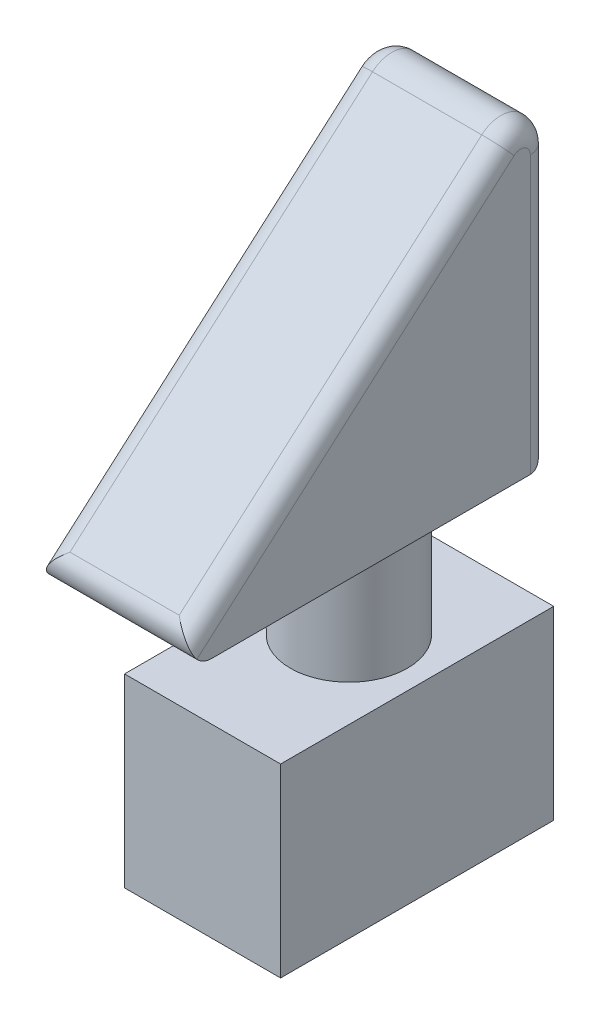
ISO-10303-21;
HEADER;
FILE_DESCRIPTION(('STEP AP214'),'2;1');
FILE_NAME('part.step','',(''),(''),'','','');
FILE_SCHEMA(('AUTOMOTIVE_DESIGN { 1 0 10303 214 1 1 1 1 }'));
ENDSEC;
DATA;
#1=APPLICATION_CONTEXT('core data for automotive mechanical design processes');
#2=APPLICATION_PROTOCOL_DEFINITION('international standard','automotive_design',2000,#1);
#3=PRODUCT_CONTEXT('',#1,'mechanical');
#4=PRODUCT('Part','Part','',(#3));
#5=PRODUCT_RELATED_PRODUCT_CATEGORY('part','',(#4));
#6=PRODUCT_DEFINITION_FORMATION('','',#4);
#7=PRODUCT_DEFINITION_CONTEXT('part definition',#1,'design');
#8=PRODUCT_DEFINITION('design','',#6,#7);
#9=PRODUCT_DEFINITION_SHAPE('','',#8);
#10=(LENGTH_UNIT() NAMED_UNIT(*) SI_UNIT(.MILLI.,.METRE.));
#11=(NAMED_UNIT(*) PLANE_ANGLE_UNIT() SI_UNIT($,.RADIAN.));
#12=(NAMED_UNIT(*) SI_UNIT($,.STERADIAN.) SOLID_ANGLE_UNIT());
#13=UNCERTAINTY_MEASURE_WITH_UNIT(LENGTH_MEASURE(1.E-05),#10,'distance_accuracy_value','');
#14=(GEOMETRIC_REPRESENTATION_CONTEXT(3) GLOBAL_UNCERTAINTY_ASSIGNED_CONTEXT((#13)) GLOBAL_UNIT_ASSIGNED_CONTEXT((#10,
#11,#12)) REPRESENTATION_CONTEXT('',''));
#15=CARTESIAN_POINT('',(0.,0.,0.));
#16=DIRECTION('',(0.,0.,1.));
#17=DIRECTION('',(1.,0.,0.));
#18=AXIS2_PLACEMENT_3D('',#15,#16,#17);
#19=CARTESIAN_POINT('',(15.2,35.,0.));
#20=DIRECTION('',(0.,0.,1.));
#21=DIRECTION('',(0.,-1.,0.));
#22=AXIS2_PLACEMENT_3D('',#19,#20,#21);
#23=PLANE('',#22);
#24=DIRECTION('',(-1.,0.,0.));
#25=VECTOR('',#24,1.);
#26=CARTESIAN_POINT('',(15.2,28.3886953202245,0.));
#27=LINE('',#26,#25);
#28=CARTESIAN_POINT('',(2.,28.3886953202245,0.));
#29=VERTEX_POINT('',#28);
#30=CARTESIAN_POINT('',(13.2,28.3886953202245,0.));
#31=VERTEX_POINT('',#30);
#32=EDGE_CURVE('E178',#29,#31,#27,.F.);
#33=ORIENTED_EDGE('',*,*,#32,.T.);
#34=DIRECTION('',(0.,1.,0.));
#35=VECTOR('',#34,1.);
#36=CARTESIAN_POINT('',(13.2,35.,0.));
#37=LINE('',#36,#35);
#38=CARTESIAN_POINT('',(13.2,2.00000000000001,0.));
#39=VERTEX_POINT('',#38);
#40=EDGE_CURVE('E207',#31,#39,#37,.F.);
#41=ORIENTED_EDGE('',*,*,#40,.T.);
#42=DIRECTION('',(-1.,0.,0.));
#43=VECTOR('',#42,1.);
#44=CARTESIAN_POINT('',(15.2,2.00000000000001,0.));
#45=LINE('',#44,#43);
#46=CARTESIAN_POINT('',(2.,2.00000000000001,0.));
#47=VERTEX_POINT('',#46);
#48=EDGE_CURVE('E205',#39,#47,#45,.T.);
#49=ORIENTED_EDGE('',*,*,#48,.T.);
#50=DIRECTION('',(0.,1.,0.));
#51=VECTOR('',#50,1.);
#52=CARTESIAN_POINT('',(2.,28.3886953202245,0.));
#53=LINE('',#52,#51);
#54=EDGE_CURVE('E203',#47,#29,#53,.T.);
#55=ORIENTED_EDGE('',*,*,#54,.T.);
#56=EDGE_LOOP('',(#33,#41,#49,#55));
#57=FACE_BOUND('',#56,.T.);
#58=ADVANCED_FACE('F39',(#57),#23,.F.);
#59=CARTESIAN_POINT('',(15.2,0.,40.));
#60=DIRECTION('',(0.,-0.752576694706878,-0.658504607868518));
#61=DIRECTION('',(0.,0.658504607868518,-0.752576694706878));
#62=AXIS2_PLACEMENT_3D('',#59,#60,#61);
#63=PLANE('',#62);
#64=DIRECTION('',(-1.,0.,0.));
#65=VECTOR('',#64,1.);
#66=CARTESIAN_POINT('',(15.2,3.50515338941375,35.9941104120986));
#67=LINE('',#66,#65);
#68=CARTESIAN_POINT('',(2.,3.50515338941375,35.9941104120986));
#69=VERTEX_POINT('',#68);
#70=CARTESIAN_POINT('',(13.2,3.50515338941375,35.9941104120986));
#71=VERTEX_POINT('',#70);
#72=EDGE_CURVE('E48',#69,#71,#67,.F.);
#73=ORIENTED_EDGE('',*,*,#72,.T.);
#74=DIRECTION('',(0.,-0.658504607868518,0.752576694706878));
#75=VECTOR('',#74,1.);
#76=CARTESIAN_POINT('',(13.2,0.,40.));
#77=LINE('',#76,#75);
#78=CARTESIAN_POINT('',(13.2,30.6464254043451,4.97551382360557));
#79=VERTEX_POINT('',#78);
#80=EDGE_CURVE('E11',#71,#79,#77,.F.);
#81=ORIENTED_EDGE('',*,*,#80,.T.);
#82=DIRECTION('',(-1.,0.,0.));
#83=VECTOR('',#82,1.);
#84=CARTESIAN_POINT('',(15.2,30.6464254043451,4.97551382360557));
#85=LINE('',#84,#83);
#86=CARTESIAN_POINT('',(2.,30.6464254043451,4.97551382360557));
#87=VERTEX_POINT('',#86);
#88=EDGE_CURVE('E176',#79,#87,#85,.T.);
#89=ORIENTED_EDGE('',*,*,#88,.T.);
#90=DIRECTION('',(0.,-0.658504607868518,0.752576694706878));
#91=VECTOR('',#90,1.);
#92=CARTESIAN_POINT('',(2.,0.,40.));
#93=LINE('',#92,#91);
#94=EDGE_CURVE('E59',#87,#69,#93,.T.);
#95=ORIENTED_EDGE('',*,*,#94,.T.);
#96=EDGE_LOOP('',(#73,#81,#89,#95));
#97=FACE_BOUND('',#96,.T.);
#98=ADVANCED_FACE('F269',(#97),#63,.F.);
#99=CARTESIAN_POINT('',(15.2,0.,0.));
#100=DIRECTION('',(0.,1.,0.));
#101=DIRECTION('',(0.,0.,1.));
#102=AXIS2_PLACEMENT_3D('',#99,#100,#101);
#103=PLANE('',#102);
#104=CARTESIAN_POINT('',(7.6,0.,13.));
#105=DIRECTION('',(0.,1.,0.));
#106=DIRECTION('',(0.,0.,1.));
#107=AXIS2_PLACEMENT_3D('',#104,#105,#106);
#108=CIRCLE('',#107,6.);
#109=CARTESIAN_POINT('',(7.6,0.,19.));
#110=VERTEX_POINT('',#109);
#111=EDGE_CURVE('E171',#110,#110,#108,.F.);
#112=ORIENTED_EDGE('',*,*,#111,.F.);
#113=EDGE_LOOP('',(#112));
#114=FACE_BOUND('',#113,.T.);
#115=DIRECTION('',(0.,0.,-1.));
#116=VECTOR('',#115,1.);
#117=CARTESIAN_POINT('',(0.,0.,0.));
#118=LINE('',#117,#116);
#119=CARTESIAN_POINT('',(0.,0.,34.6771011963615));
#120=VERTEX_POINT('',#119);
#121=CARTESIAN_POINT('',(0.,0.,2.));
#122=VERTEX_POINT('',#121);
#123=EDGE_CURVE('E162',#120,#122,#118,.T.);
#124=ORIENTED_EDGE('',*,*,#123,.T.);
#125=DIRECTION('',(-1.,0.,0.));
#126=VECTOR('',#125,1.);
#127=CARTESIAN_POINT('',(15.2,0.,2.));
#128=LINE('',#127,#126);
#129=CARTESIAN_POINT('',(15.2,0.,2.));
#130=VERTEX_POINT('',#129);
#131=EDGE_CURVE('E211',#122,#130,#128,.F.);
#132=ORIENTED_EDGE('',*,*,#131,.T.);
#133=DIRECTION('',(0.,0.,-1.));
#134=VECTOR('',#133,1.);
#135=CARTESIAN_POINT('',(15.2,0.,0.));
#136=LINE('',#135,#134);
#137=CARTESIAN_POINT('',(15.2,0.,34.6771011963615));
#138=VERTEX_POINT('',#137);
#139=EDGE_CURVE('E168',#138,#130,#136,.T.);
#140=ORIENTED_EDGE('',*,*,#139,.F.);
#141=DIRECTION('',(-1.,0.,0.));
#142=VECTOR('',#141,1.);
#143=CARTESIAN_POINT('',(15.2,0.,34.6771011963615));
#144=LINE('',#143,#142);
#145=EDGE_CURVE('E209',#138,#120,#144,.T.);
#146=ORIENTED_EDGE('',*,*,#145,.T.);
#147=EDGE_LOOP('',(#124,#132,#140,#146));
#148=FACE_BOUND('',#147,.T.);
#149=ADVANCED_FACE('F275',(#114,#148),#103,.F.);
#150=CARTESIAN_POINT('',(15.2,0.,0.));
#151=DIRECTION('',(-1.,0.,0.));
#152=DIRECTION('',(0.,0.,1.));
#153=AXIS2_PLACEMENT_3D('',#150,#151,#152);
#154=PLANE('',#153);
#155=ORIENTED_EDGE('',*,*,#139,.T.);
#156=DIRECTION('',(0.,1.,0.));
#157=VECTOR('',#156,1.);
#158=CARTESIAN_POINT('',(15.2,0.,2.));
#159=LINE('',#158,#157);
#160=CARTESIAN_POINT('',(15.2,28.3886953202245,2.00000000000001));
#161=VERTEX_POINT('',#160);
#162=EDGE_CURVE('E188',#130,#161,#159,.T.);
#163=ORIENTED_EDGE('',*,*,#162,.T.);
#164=CARTESIAN_POINT('',(15.2,28.3886953202245,3.00000000000001));
#165=DIRECTION('',(-1.,0.,0.));
#166=DIRECTION('',(0.,0.,1.));
#167=AXIS2_PLACEMENT_3D('',#164,#165,#166);
#168=CIRCLE('',#167,1.);
#169=CARTESIAN_POINT('',(15.2,29.1412720149314,3.65850460786853));
#170=VERTEX_POINT('',#169);
#171=EDGE_CURVE('E185',#161,#170,#168,.F.);
#172=ORIENTED_EDGE('',*,*,#171,.T.);
#173=DIRECTION('',(0.,-0.658504607868518,0.752576694706878));
#174=VECTOR('',#173,1.);
#175=CARTESIAN_POINT('',(15.2,18.3178554601438,16.0281235276258));
#176=LINE('',#175,#174);
#177=CARTESIAN_POINT('',(15.2,0.682990784262961,36.1822545857753));
#178=VERTEX_POINT('',#177);
#179=EDGE_CURVE('E181',#170,#178,#176,.T.);
#180=ORIENTED_EDGE('',*,*,#179,.T.);
#181=CARTESIAN_POINT('',(15.2,2.,34.6771011963615));
#182=DIRECTION('',(-1.,0.,0.));
#183=DIRECTION('',(0.,0.,1.));
#184=AXIS2_PLACEMENT_3D('',#181,#182,#183);
#185=CIRCLE('',#184,2.);
#186=EDGE_CURVE('E183',#178,#138,#185,.F.);
#187=ORIENTED_EDGE('',*,*,#186,.T.);
#188=EDGE_LOOP('',(#155,#163,#172,#180,#187));
#189=FACE_BOUND('',#188,.T.);
#190=ADVANCED_FACE('F338',(#189),#154,.F.);
#191=CARTESIAN_POINT('',(0.,0.,0.));
#192=DIRECTION('',(-1.,0.,0.));
#193=DIRECTION('',(0.,0.,1.));
#194=AXIS2_PLACEMENT_3D('',#191,#192,#193);
#195=PLANE('',#194);
#196=CARTESIAN_POINT('',(0.,28.3886953202245,3.00000000000001));
#197=DIRECTION('',(-1.,0.,0.));
#198=DIRECTION('',(0.,0.,1.));
#199=AXIS2_PLACEMENT_3D('',#196,#197,#198);
#200=CIRCLE('',#199,1.);
#201=CARTESIAN_POINT('',(0.,29.1412720149314,3.65850460786853));
#202=VERTEX_POINT('',#201);
#203=CARTESIAN_POINT('',(0.,28.3886953202245,2.00000000000001));
#204=VERTEX_POINT('',#203);
#205=EDGE_CURVE('E199',#202,#204,#200,.T.);
#206=ORIENTED_EDGE('',*,*,#205,.T.);
#207=DIRECTION('',(0.,1.,0.));
#208=VECTOR('',#207,1.);
#209=CARTESIAN_POINT('',(0.,0.,2.));
#210=LINE('',#209,#208);
#211=EDGE_CURVE('E201',#204,#122,#210,.F.);
#212=ORIENTED_EDGE('',*,*,#211,.T.);
#213=ORIENTED_EDGE('',*,*,#123,.F.);
#214=CARTESIAN_POINT('',(0.,2.,34.6771011963615));
#215=DIRECTION('',(-1.,0.,0.));
#216=DIRECTION('',(0.,0.,1.));
#217=AXIS2_PLACEMENT_3D('',#214,#215,#216);
#218=CIRCLE('',#217,2.);
#219=CARTESIAN_POINT('',(0.,0.682990784262965,36.1822545857753));
#220=VERTEX_POINT('',#219);
#221=EDGE_CURVE('E197',#120,#220,#218,.T.);
#222=ORIENTED_EDGE('',*,*,#221,.T.);
#223=DIRECTION('',(0.,-0.658504607868518,0.752576694706878));
#224=VECTOR('',#223,1.);
#225=CARTESIAN_POINT('',(0.,29.1412720149314,3.65850460786853));
#226=LINE('',#225,#224);
#227=EDGE_CURVE('E195',#220,#202,#226,.F.);
#228=ORIENTED_EDGE('',*,*,#227,.T.);
#229=EDGE_LOOP('',(#206,#212,#213,#222,#228));
#230=FACE_BOUND('',#229,.T.);
#231=ADVANCED_FACE('F334',(#230),#195,.T.);
#232=CARTESIAN_POINT('',(7.6,-12.5,13.));
#233=DIRECTION('',(0.,1.,0.));
#234=DIRECTION('',(0.,0.,1.));
#235=AXIS2_PLACEMENT_3D('',#232,#233,#234);
#236=CYLINDRICAL_SURFACE('',#235,6.);
#237=CARTESIAN_POINT('',(7.6,-12.5,13.));
#238=DIRECTION('',(0.,-1.,0.));
#239=DIRECTION('',(0.,0.,-1.));
#240=AXIS2_PLACEMENT_3D('',#237,#238,#239);
#241=CIRCLE('',#240,6.);
#242=CARTESIAN_POINT('',(7.6,-12.5,7.));
#243=VERTEX_POINT('',#242);
#244=EDGE_CURVE('E159',#243,#243,#241,.T.);
#245=ORIENTED_EDGE('',*,*,#244,.F.);
#246=EDGE_LOOP('',(#245));
#247=FACE_BOUND('',#246,.T.);
#248=ORIENTED_EDGE('',*,*,#111,.T.);
#249=EDGE_LOOP('',(#248));
#250=FACE_BOUND('',#249,.T.);
#251=ADVANCED_FACE('F345',(#247,#250),#236,.T.);
#252=CARTESIAN_POINT('',(-0.4,-31.5,0.));
#253=DIRECTION('',(1.,0.,0.));
#254=DIRECTION('',(0.,0.,-1.));
#255=AXIS2_PLACEMENT_3D('',#252,#253,#254);
#256=PLANE('',#255);
#257=DIRECTION('',(0.,0.,-1.));
#258=VECTOR('',#257,1.);
#259=CARTESIAN_POINT('',(-0.4,-12.5,0.));
#260=LINE('',#259,#258);
#261=CARTESIAN_POINT('',(-0.400000000000001,-12.5,28.));
#262=VERTEX_POINT('',#261);
#263=CARTESIAN_POINT('',(-0.4,-12.5,0.));
#264=VERTEX_POINT('',#263);
#265=EDGE_CURVE('E158',#262,#264,#260,.T.);
#266=ORIENTED_EDGE('',*,*,#265,.T.);
#267=DIRECTION('',(0.,1.,0.));
#268=VECTOR('',#267,1.);
#269=CARTESIAN_POINT('',(-0.4,-31.5,0.));
#270=LINE('',#269,#268);
#271=CARTESIAN_POINT('',(-0.4,-31.5,0.));
#272=VERTEX_POINT('',#271);
#273=EDGE_CURVE('E138',#272,#264,#270,.T.);
#274=ORIENTED_EDGE('',*,*,#273,.F.);
#275=DIRECTION('',(0.,0.,-1.));
#276=VECTOR('',#275,1.);
#277=CARTESIAN_POINT('',(-0.4,-31.5,0.));
#278=LINE('',#277,#276);
#279=CARTESIAN_POINT('',(-0.400000000000001,-31.5,28.));
#280=VERTEX_POINT('',#279);
#281=EDGE_CURVE('E145',#280,#272,#278,.T.);
#282=ORIENTED_EDGE('',*,*,#281,.F.);
#283=DIRECTION('',(0.,1.,0.));
#284=VECTOR('',#283,1.);
#285=CARTESIAN_POINT('',(-0.400000000000001,-31.5,28.));
#286=LINE('',#285,#284);
#287=EDGE_CURVE('E249',#280,#262,#286,.T.);
#288=ORIENTED_EDGE('',*,*,#287,.T.);
#289=EDGE_LOOP('',(#266,#274,#282,#288));
#290=FACE_BOUND('',#289,.T.);
#291=ADVANCED_FACE('F156',(#290),#256,.F.);
#292=CARTESIAN_POINT('',(-0.4,-31.5,0.));
#293=DIRECTION('',(0.,0.,1.));
#294=DIRECTION('',(1.,0.,0.));
#295=AXIS2_PLACEMENT_3D('',#292,#293,#294);
#296=PLANE('',#295);
#297=DIRECTION('',(1.,0.,0.));
#298=VECTOR('',#297,1.);
#299=CARTESIAN_POINT('',(-0.4,-12.5,0.));
#300=LINE('',#299,#298);
#301=CARTESIAN_POINT('',(15.6,-12.5,0.));
#302=VERTEX_POINT('',#301);
#303=EDGE_CURVE('E240',#264,#302,#300,.T.);
#304=ORIENTED_EDGE('',*,*,#303,.T.);
#305=DIRECTION('',(0.,1.,0.));
#306=VECTOR('',#305,1.);
#307=CARTESIAN_POINT('',(15.6,-31.5,0.));
#308=LINE('',#307,#306);
#309=CARTESIAN_POINT('',(15.6,-31.5,0.));
#310=VERTEX_POINT('',#309);
#311=EDGE_CURVE('E141',#310,#302,#308,.T.);
#312=ORIENTED_EDGE('',*,*,#311,.F.);
#313=DIRECTION('',(1.,0.,0.));
#314=VECTOR('',#313,1.);
#315=CARTESIAN_POINT('',(-0.4,-31.5,0.));
#316=LINE('',#315,#314);
#317=EDGE_CURVE('E134',#272,#310,#316,.T.);
#318=ORIENTED_EDGE('',*,*,#317,.F.);
#319=ORIENTED_EDGE('',*,*,#273,.T.);
#320=EDGE_LOOP('',(#304,#312,#318,#319));
#321=FACE_BOUND('',#320,.T.);
#322=ADVANCED_FACE('F136',(#321),#296,.F.);
#323=CARTESIAN_POINT('',(15.6,-31.5,0.));
#324=DIRECTION('',(-1.,0.,0.));
#325=DIRECTION('',(0.,0.,1.));
#326=AXIS2_PLACEMENT_3D('',#323,#324,#325);
#327=PLANE('',#326);
#328=DIRECTION('',(0.,0.,1.));
#329=VECTOR('',#328,1.);
#330=CARTESIAN_POINT('',(15.6,-12.5,0.));
#331=LINE('',#330,#329);
#332=CARTESIAN_POINT('',(15.6,-12.5,28.));
#333=VERTEX_POINT('',#332);
#334=EDGE_CURVE('E242',#302,#333,#331,.T.);
#335=ORIENTED_EDGE('',*,*,#334,.T.);
#336=DIRECTION('',(0.,1.,0.));
#337=VECTOR('',#336,1.);
#338=CARTESIAN_POINT('',(15.6,-31.5,28.));
#339=LINE('',#338,#337);
#340=CARTESIAN_POINT('',(15.6,-31.5,28.));
#341=VERTEX_POINT('',#340);
#342=EDGE_CURVE('E164',#341,#333,#339,.T.);
#343=ORIENTED_EDGE('',*,*,#342,.F.);
#344=DIRECTION('',(0.,0.,1.));
#345=VECTOR('',#344,1.);
#346=CARTESIAN_POINT('',(15.6,-31.5,0.));
#347=LINE('',#346,#345);
#348=EDGE_CURVE('E144',#310,#341,#347,.T.);
#349=ORIENTED_EDGE('',*,*,#348,.F.);
#350=ORIENTED_EDGE('',*,*,#311,.T.);
#351=EDGE_LOOP('',(#335,#343,#349,#350));
#352=FACE_BOUND('',#351,.T.);
#353=ADVANCED_FACE('F259',(#352),#327,.F.);
#354=CARTESIAN_POINT('',(-0.400000000000001,-31.5,28.));
#355=DIRECTION('',(0.,0.,-1.));
#356=DIRECTION('',(-1.,0.,0.));
#357=AXIS2_PLACEMENT_3D('',#354,#355,#356);
#358=PLANE('',#357);
#359=DIRECTION('',(-1.,0.,0.));
#360=VECTOR('',#359,1.);
#361=CARTESIAN_POINT('',(-0.400000000000001,-12.5,28.));
#362=LINE('',#361,#360);
#363=EDGE_CURVE('E154',#333,#262,#362,.T.);
#364=ORIENTED_EDGE('',*,*,#363,.T.);
#365=ORIENTED_EDGE('',*,*,#287,.F.);
#366=DIRECTION('',(-1.,0.,0.));
#367=VECTOR('',#366,1.);
#368=CARTESIAN_POINT('',(-0.400000000000001,-31.5,28.));
#369=LINE('',#368,#367);
#370=EDGE_CURVE('E150',#341,#280,#369,.T.);
#371=ORIENTED_EDGE('',*,*,#370,.F.);
#372=ORIENTED_EDGE('',*,*,#342,.T.);
#373=EDGE_LOOP('',(#364,#365,#371,#372));
#374=FACE_BOUND('',#373,.T.);
#375=ADVANCED_FACE('F254',(#374),#358,.F.);
#376=CARTESIAN_POINT('',(0.,-31.5,0.));
#377=DIRECTION('',(0.,1.,0.));
#378=DIRECTION('',(0.,0.,1.));
#379=AXIS2_PLACEMENT_3D('',#376,#377,#378);
#380=PLANE('',#379);
#381=ORIENTED_EDGE('',*,*,#281,.T.);
#382=ORIENTED_EDGE('',*,*,#317,.T.);
#383=ORIENTED_EDGE('',*,*,#348,.T.);
#384=ORIENTED_EDGE('',*,*,#370,.T.);
#385=EDGE_LOOP('',(#381,#382,#383,#384));
#386=FACE_BOUND('',#385,.T.);
#387=ADVANCED_FACE('F148',(#386),#380,.F.);
#388=CARTESIAN_POINT('',(0.,-12.5,0.));
#389=DIRECTION('',(0.,1.,0.));
#390=DIRECTION('',(0.,0.,1.));
#391=AXIS2_PLACEMENT_3D('',#388,#389,#390);
#392=PLANE('',#391);
#393=ORIENTED_EDGE('',*,*,#244,.T.);
#394=EDGE_LOOP('',(#393));
#395=FACE_BOUND('',#394,.T.);
#396=ORIENTED_EDGE('',*,*,#265,.F.);
#397=ORIENTED_EDGE('',*,*,#363,.F.);
#398=ORIENTED_EDGE('',*,*,#334,.F.);
#399=ORIENTED_EDGE('',*,*,#303,.F.);
#400=EDGE_LOOP('',(#396,#397,#398,#399));
#401=FACE_BOUND('',#400,.T.);
#402=ADVANCED_FACE('F258',(#395,#401),#392,.T.);
#403=CARTESIAN_POINT('',(15.2,28.3886953202245,3.00000000000001));
#404=DIRECTION('',(-1.,0.,0.));
#405=DIRECTION('',(0.,0.,1.));
#406=AXIS2_PLACEMENT_3D('',#403,#404,#405);
#407=CYLINDRICAL_SURFACE('',#406,3.);
#408=ORIENTED_EDGE('',*,*,#88,.F.);
#409=CARTESIAN_POINT('',(13.2,28.3886953202245,3.00000000000001));
#410=DIRECTION('',(-1.,0.,0.));
#411=DIRECTION('',(0.,0.,1.));
#412=AXIS2_PLACEMENT_3D('',#409,#410,#411);
#413=CIRCLE('',#412,3.);
#414=EDGE_CURVE('E192',#79,#31,#413,.T.);
#415=ORIENTED_EDGE('',*,*,#414,.T.);
#416=ORIENTED_EDGE('',*,*,#32,.F.);
#417=CARTESIAN_POINT('',(2.,28.3886953202245,3.00000000000001));
#418=DIRECTION('',(-1.,0.,0.));
#419=DIRECTION('',(0.,0.,1.));
#420=AXIS2_PLACEMENT_3D('',#417,#418,#419);
#421=CIRCLE('',#420,3.);
#422=EDGE_CURVE('E190',#29,#87,#421,.F.);
#423=ORIENTED_EDGE('',*,*,#422,.T.);
#424=EDGE_LOOP('',(#408,#415,#416,#423));
#425=FACE_BOUND('',#424,.T.);
#426=ADVANCED_FACE('F279',(#425),#407,.T.);
#427=CARTESIAN_POINT('',(2.,28.3886953202245,3.00000000000001));
#428=DIRECTION('',(-1.,0.,0.));
#429=DIRECTION('',(0.,0.,1.));
#430=AXIS2_PLACEMENT_3D('',#427,#428,#429);
#431=DEGENERATE_TOROIDAL_SURFACE('',#430,1.,2.,.T.);
#432=CARTESIAN_POINT('',(2.,29.1412720149314,3.65850460786853));
#433=DIRECTION('',(0.,-0.65850460786852,0.752576694706877));
#434=DIRECTION('',(0.,-0.752576694706877,-0.65850460786852));
#435=AXIS2_PLACEMENT_3D('',#432,#433,#434);
#436=CIRCLE('',#435,2.);
#437=EDGE_CURVE('E230',#87,#202,#436,.T.);
#438=ORIENTED_EDGE('',*,*,#437,.F.);
#439=ORIENTED_EDGE('',*,*,#422,.F.);
#440=CARTESIAN_POINT('',(2.,28.3886953202245,2.00000000000001));
#441=DIRECTION('',(0.,-1.,0.));
#442=DIRECTION('',(0.,0.,-1.));
#443=AXIS2_PLACEMENT_3D('',#440,#441,#442);
#444=CIRCLE('',#443,2.);
#445=EDGE_CURVE('E43',#204,#29,#444,.T.);
#446=ORIENTED_EDGE('',*,*,#445,.F.);
#447=ORIENTED_EDGE('',*,*,#205,.F.);
#448=EDGE_LOOP('',(#438,#439,#446,#447));
#449=FACE_BOUND('',#448,.T.);
#450=ADVANCED_FACE('F41',(#449),#431,.T.);
#451=CARTESIAN_POINT('',(2.,35.,2.));
#452=DIRECTION('',(0.,-1.,0.));
#453=DIRECTION('',(0.,0.,-1.));
#454=AXIS2_PLACEMENT_3D('',#451,#452,#453);
#455=CYLINDRICAL_SURFACE('',#454,2.);
#456=ORIENTED_EDGE('',*,*,#445,.T.);
#457=ORIENTED_EDGE('',*,*,#54,.F.);
#458=CARTESIAN_POINT('',(2.,2.00000000000001,2.));
#459=DIRECTION('',(0.707106781186547,-0.707106781186547,0.));
#460=DIRECTION('',(-0.707106781186547,-0.707106781186547,0.));
#461=AXIS2_PLACEMENT_3D('',#458,#459,#460);
#462=ELLIPSE('',#461,2.82842712474619,2.);
#463=EDGE_CURVE('E228',#122,#47,#462,.T.);
#464=ORIENTED_EDGE('',*,*,#463,.F.);
#465=ORIENTED_EDGE('',*,*,#211,.F.);
#466=EDGE_LOOP('',(#456,#457,#464,#465));
#467=FACE_BOUND('',#466,.T.);
#468=ADVANCED_FACE('F305',(#467),#455,.T.);
#469=CARTESIAN_POINT('',(2.,-1.50515338941376,38.682990784263));
#470=DIRECTION('',(0.,0.658504607868518,-0.752576694706878));
#471=DIRECTION('',(0.,0.752576694706878,0.658504607868518));
#472=AXIS2_PLACEMENT_3D('',#469,#470,#471);
#473=CYLINDRICAL_SURFACE('',#472,2.);
#474=ORIENTED_EDGE('',*,*,#437,.T.);
#475=ORIENTED_EDGE('',*,*,#227,.F.);
#476=CARTESIAN_POINT('',(2.,2.,34.6771011963615));
#477=DIRECTION('',(-0.707106781186547,0.465633073666417,-0.532152084190191));
#478=DIRECTION('',(0.707106781186547,0.465633073666417,-0.532152084190191));
#479=AXIS2_PLACEMENT_3D('',#476,#477,#478);
#480=ELLIPSE('',#479,2.82842712474619,2.);
#481=EDGE_CURVE('E225',#69,#220,#480,.F.);
#482=ORIENTED_EDGE('',*,*,#481,.F.);
#483=ORIENTED_EDGE('',*,*,#94,.F.);
#484=EDGE_LOOP('',(#474,#475,#482,#483));
#485=FACE_BOUND('',#484,.T.);
#486=ADVANCED_FACE('F302',(#485),#473,.T.);
#487=CARTESIAN_POINT('',(15.2,2.00000000000001,2.));
#488=DIRECTION('',(-1.,0.,0.));
#489=DIRECTION('',(0.,0.,1.));
#490=AXIS2_PLACEMENT_3D('',#487,#488,#489);
#491=CYLINDRICAL_SURFACE('',#490,2.);
#492=ORIENTED_EDGE('',*,*,#463,.T.);
#493=ORIENTED_EDGE('',*,*,#48,.F.);
#494=CARTESIAN_POINT('',(13.2,2.00000000000001,2.));
#495=DIRECTION('',(0.707106781186547,0.707106781186547,0.));
#496=DIRECTION('',(-0.707106781186547,0.707106781186547,0.));
#497=AXIS2_PLACEMENT_3D('',#494,#495,#496);
#498=ELLIPSE('',#497,2.82842712474619,2.);
#499=EDGE_CURVE('E222',#130,#39,#498,.T.);
#500=ORIENTED_EDGE('',*,*,#499,.F.);
#501=ORIENTED_EDGE('',*,*,#131,.F.);
#502=EDGE_LOOP('',(#492,#493,#500,#501));
#503=FACE_BOUND('',#502,.T.);
#504=ADVANCED_FACE('F298',(#503),#491,.T.);
#505=CARTESIAN_POINT('',(15.2,2.,34.6771011963615));
#506=DIRECTION('',(-1.,0.,0.));
#507=DIRECTION('',(0.,0.,1.));
#508=AXIS2_PLACEMENT_3D('',#505,#506,#507);
#509=CYLINDRICAL_SURFACE('',#508,2.);
#510=ORIENTED_EDGE('',*,*,#145,.F.);
#511=ORIENTED_EDGE('',*,*,#186,.F.);
#512=CARTESIAN_POINT('',(13.2,2.,34.6771011963615));
#513=DIRECTION('',(-0.707106781186547,-0.465633073666417,0.532152084190191));
#514=DIRECTION('',(0.707106781186547,-0.465633073666417,0.532152084190191));
#515=AXIS2_PLACEMENT_3D('',#512,#513,#514);
#516=ELLIPSE('',#515,2.82842712474619,2.);
#517=EDGE_CURVE('E219',#71,#178,#516,.F.);
#518=ORIENTED_EDGE('',*,*,#517,.F.);
#519=ORIENTED_EDGE('',*,*,#72,.F.);
#520=ORIENTED_EDGE('',*,*,#481,.T.);
#521=ORIENTED_EDGE('',*,*,#221,.F.);
#522=EDGE_LOOP('',(#510,#511,#518,#519,#520,#521));
#523=FACE_BOUND('',#522,.T.);
#524=ADVANCED_FACE('F294',(#523),#509,.T.);
#525=CARTESIAN_POINT('',(13.2,0.,2.));
#526=DIRECTION('',(0.,1.,0.));
#527=DIRECTION('',(0.,0.,1.));
#528=AXIS2_PLACEMENT_3D('',#525,#526,#527);
#529=CYLINDRICAL_SURFACE('',#528,2.);
#530=ORIENTED_EDGE('',*,*,#499,.T.);
#531=ORIENTED_EDGE('',*,*,#40,.F.);
#532=CARTESIAN_POINT('',(13.2,28.3886953202245,2.));
#533=DIRECTION('',(0.,1.,0.));
#534=DIRECTION('',(0.,0.,1.));
#535=AXIS2_PLACEMENT_3D('',#532,#533,#534);
#536=CIRCLE('',#535,2.);
#537=EDGE_CURVE('E217',#161,#31,#536,.T.);
#538=ORIENTED_EDGE('',*,*,#537,.F.);
#539=ORIENTED_EDGE('',*,*,#162,.F.);
#540=EDGE_LOOP('',(#530,#531,#538,#539));
#541=FACE_BOUND('',#540,.T.);
#542=ADVANCED_FACE('F290',(#541),#529,.T.);
#543=CARTESIAN_POINT('',(13.2,18.3178554601438,16.0281235276258));
#544=DIRECTION('',(0.,-0.658504607868518,0.752576694706878));
#545=DIRECTION('',(0.,-0.752576694706878,-0.658504607868518));
#546=AXIS2_PLACEMENT_3D('',#543,#544,#545);
#547=CYLINDRICAL_SURFACE('',#546,2.);
#548=ORIENTED_EDGE('',*,*,#517,.T.);
#549=ORIENTED_EDGE('',*,*,#179,.F.);
#550=CARTESIAN_POINT('',(13.2,29.1412720149314,3.65850460786853));
#551=DIRECTION('',(0.,0.658504607868518,-0.752576694706878));
#552=DIRECTION('',(0.,0.752576694706878,0.658504607868518));
#553=AXIS2_PLACEMENT_3D('',#550,#551,#552);
#554=CIRCLE('',#553,2.);
#555=EDGE_CURVE('E215',#79,#170,#554,.T.);
#556=ORIENTED_EDGE('',*,*,#555,.F.);
#557=ORIENTED_EDGE('',*,*,#80,.F.);
#558=EDGE_LOOP('',(#548,#549,#556,#557));
#559=FACE_BOUND('',#558,.T.);
#560=ADVANCED_FACE('F286',(#559),#547,.T.);
#561=CARTESIAN_POINT('',(13.2,28.3886953202245,3.00000000000001));
#562=DIRECTION('',(-1.,0.,0.));
#563=DIRECTION('',(0.,0.,1.));
#564=AXIS2_PLACEMENT_3D('',#561,#562,#563);
#565=DEGENERATE_TOROIDAL_SURFACE('',#564,1.,2.,.T.);
#566=ORIENTED_EDGE('',*,*,#537,.T.);
#567=ORIENTED_EDGE('',*,*,#414,.F.);
#568=ORIENTED_EDGE('',*,*,#555,.T.);
#569=ORIENTED_EDGE('',*,*,#171,.F.);
#570=EDGE_LOOP('',(#566,#567,#568,#569));
#571=FACE_BOUND('',#570,.T.);
#572=ADVANCED_FACE('F283',(#571),#565,.T.);
#573=CLOSED_SHELL('',(#58,#98,#149,#190,#231,#251,#291,#322,#353,#375,#387,#402,#426,#450,#468,
#486,#504,#524,#542,#560,#572));
#574=MANIFOLD_SOLID_BREP('B2',#573);
#575=ADVANCED_BREP_SHAPE_REPRESENTATION('',(#18,#574),#14);
#576=SHAPE_DEFINITION_REPRESENTATION(#9,#575);
ENDSEC;
END-ISO-10303-21;
